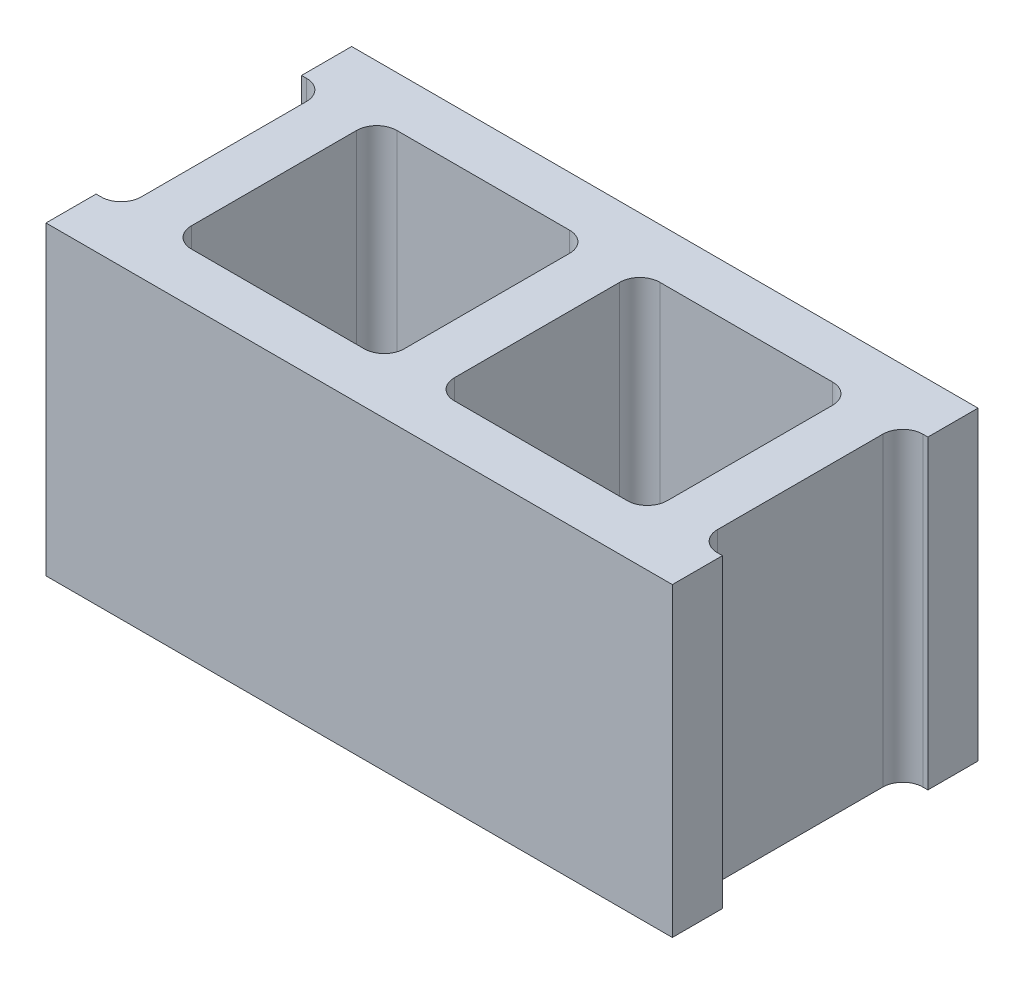
ISO-10303-21;
HEADER;
FILE_DESCRIPTION(('STEP AP214'),'2;1');
FILE_NAME('part.step','',(''),(''),'','','');
FILE_SCHEMA(('AUTOMOTIVE_DESIGN { 1 0 10303 214 1 1 1 1 }'));
ENDSEC;
DATA;
#1=APPLICATION_CONTEXT('core data for automotive mechanical design processes');
#2=APPLICATION_PROTOCOL_DEFINITION('international standard','automotive_design',2000,#1);
#3=PRODUCT_CONTEXT('',#1,'mechanical');
#4=PRODUCT('Part','Part','',(#3));
#5=PRODUCT_RELATED_PRODUCT_CATEGORY('part','',(#4));
#6=PRODUCT_DEFINITION_FORMATION('','',#4);
#7=PRODUCT_DEFINITION_CONTEXT('part definition',#1,'design');
#8=PRODUCT_DEFINITION('design','',#6,#7);
#9=PRODUCT_DEFINITION_SHAPE('','',#8);
#10=(LENGTH_UNIT() NAMED_UNIT(*) SI_UNIT(.MILLI.,.METRE.));
#11=(NAMED_UNIT(*) PLANE_ANGLE_UNIT() SI_UNIT($,.RADIAN.));
#12=(NAMED_UNIT(*) SI_UNIT($,.STERADIAN.) SOLID_ANGLE_UNIT());
#13=UNCERTAINTY_MEASURE_WITH_UNIT(LENGTH_MEASURE(1.E-05),#10,'distance_accuracy_value','');
#14=(GEOMETRIC_REPRESENTATION_CONTEXT(3) GLOBAL_UNCERTAINTY_ASSIGNED_CONTEXT((#13)) GLOBAL_UNIT_ASSIGNED_CONTEXT((#10,
#11,#12)) REPRESENTATION_CONTEXT('',''));
#15=CARTESIAN_POINT('',(0.,0.,0.));
#16=DIRECTION('',(0.,0.,1.));
#17=DIRECTION('',(1.,0.,0.));
#18=AXIS2_PLACEMENT_3D('',#15,#16,#17);
#19=CARTESIAN_POINT('',(195.262500000001,193.675,-52.3875));
#20=DIRECTION('',(0.,-1.,0.));
#21=DIRECTION('',(0.,0.,-1.));
#22=AXIS2_PLACEMENT_3D('',#19,#20,#21);
#23=PLANE('',#22);
#24=CARTESIAN_POINT('',(-138.1125,193.675,52.3874999999999));
#25=DIRECTION('',(0.,1.,0.));
#26=DIRECTION('',(0.,0.,-1.));
#27=AXIS2_PLACEMENT_3D('',#24,#25,#26);
#28=CIRCLE('',#27,12.7);
#29=CARTESIAN_POINT('',(-150.8125,193.675,52.3874999999998));
#30=VERTEX_POINT('',#29);
#31=CARTESIAN_POINT('',(-138.1125,193.675,65.0874999999998));
#32=VERTEX_POINT('',#31);
#33=EDGE_CURVE('E322',#30,#32,#28,.T.);
#34=ORIENTED_EDGE('',*,*,#33,.F.);
#35=DIRECTION('',(0.,0.,1.));
#36=VECTOR('',#35,1.);
#37=CARTESIAN_POINT('',(-150.8125,193.675,52.3874999999998));
#38=LINE('',#37,#36);
#39=CARTESIAN_POINT('',(-150.8125,193.675,-52.3875000000001));
#40=VERTEX_POINT('',#39);
#41=EDGE_CURVE('E338',#40,#30,#38,.T.);
#42=ORIENTED_EDGE('',*,*,#41,.F.);
#43=CARTESIAN_POINT('',(-138.1125,193.675,-52.3875000000001));
#44=DIRECTION('',(0.,1.,0.));
#45=DIRECTION('',(0.,0.,1.));
#46=AXIS2_PLACEMENT_3D('',#43,#44,#45);
#47=CIRCLE('',#46,12.7);
#48=CARTESIAN_POINT('',(-138.1125,193.675,-65.0875000000001));
#49=VERTEX_POINT('',#48);
#50=EDGE_CURVE('E335',#49,#40,#47,.T.);
#51=ORIENTED_EDGE('',*,*,#50,.F.);
#52=DIRECTION('',(-1.,0.,0.));
#53=VECTOR('',#52,1.);
#54=CARTESIAN_POINT('',(-28.575,193.675,-65.0875));
#55=LINE('',#54,#53);
#56=CARTESIAN_POINT('',(-28.575,193.675,-65.0875));
#57=VERTEX_POINT('',#56);
#58=EDGE_CURVE('E333',#57,#49,#55,.T.);
#59=ORIENTED_EDGE('',*,*,#58,.F.);
#60=CARTESIAN_POINT('',(-28.575,193.675,-52.3875));
#61=DIRECTION('',(0.,1.,0.));
#62=DIRECTION('',(0.,0.,1.));
#63=AXIS2_PLACEMENT_3D('',#60,#61,#62);
#64=CIRCLE('',#63,12.7);
#65=CARTESIAN_POINT('',(-15.875,193.675,-52.3875));
#66=VERTEX_POINT('',#65);
#67=EDGE_CURVE('E331',#66,#57,#64,.T.);
#68=ORIENTED_EDGE('',*,*,#67,.F.);
#69=DIRECTION('',(0.,0.,-1.));
#70=VECTOR('',#69,1.);
#71=CARTESIAN_POINT('',(-15.875,193.675,52.3875));
#72=LINE('',#71,#70);
#73=CARTESIAN_POINT('',(-15.875,193.675,52.3875));
#74=VERTEX_POINT('',#73);
#75=EDGE_CURVE('E329',#74,#66,#72,.T.);
#76=ORIENTED_EDGE('',*,*,#75,.F.);
#77=CARTESIAN_POINT('',(-28.575,193.675,52.3875));
#78=DIRECTION('',(0.,1.,0.));
#79=DIRECTION('',(0.,0.,1.));
#80=AXIS2_PLACEMENT_3D('',#77,#78,#79);
#81=CIRCLE('',#80,12.7);
#82=CARTESIAN_POINT('',(-28.575,193.675,65.0875));
#83=VERTEX_POINT('',#82);
#84=EDGE_CURVE('E327',#83,#74,#81,.T.);
#85=ORIENTED_EDGE('',*,*,#84,.F.);
#86=DIRECTION('',(1.,0.,0.));
#87=VECTOR('',#86,1.);
#88=CARTESIAN_POINT('',(-28.575,193.675,65.0875));
#89=LINE('',#88,#87);
#90=EDGE_CURVE('E324',#32,#83,#89,.T.);
#91=ORIENTED_EDGE('',*,*,#90,.F.);
#92=EDGE_LOOP('',(#34,#42,#51,#59,#68,#76,#85,#91));
#93=FACE_BOUND('',#92,.T.);
#94=DIRECTION('',(0.,0.,1.));
#95=VECTOR('',#94,1.);
#96=CARTESIAN_POINT('',(-198.4375,193.675,-65.0875));
#97=LINE('',#96,#95);
#98=CARTESIAN_POINT('',(-198.4375,193.675,-96.8375));
#99=VERTEX_POINT('',#98);
#100=CARTESIAN_POINT('',(-198.4375,193.675,-65.0875));
#101=VERTEX_POINT('',#100);
#102=EDGE_CURVE('E381',#99,#101,#97,.T.);
#103=ORIENTED_EDGE('',*,*,#102,.T.);
#104=DIRECTION('',(1.,0.,0.));
#105=VECTOR('',#104,1.);
#106=CARTESIAN_POINT('',(-198.4375,193.675,-65.0875));
#107=LINE('',#106,#105);
#108=CARTESIAN_POINT('',(-195.2625,193.675,-65.0875));
#109=VERTEX_POINT('',#108);
#110=EDGE_CURVE('E384',#101,#109,#107,.T.);
#111=ORIENTED_EDGE('',*,*,#110,.T.);
#112=CARTESIAN_POINT('',(-195.2625,193.675,-52.3875));
#113=DIRECTION('',(0.,-1.,0.));
#114=DIRECTION('',(0.,0.,1.));
#115=AXIS2_PLACEMENT_3D('',#112,#113,#114);
#116=CIRCLE('',#115,12.7);
#117=CARTESIAN_POINT('',(-182.5625,193.675,-52.3874999999999));
#118=VERTEX_POINT('',#117);
#119=EDGE_CURVE('E387',#109,#118,#116,.T.);
#120=ORIENTED_EDGE('',*,*,#119,.T.);
#121=DIRECTION('',(0.,0.,1.));
#122=VECTOR('',#121,1.);
#123=CARTESIAN_POINT('',(-182.5625,193.675,-52.3874999999999));
#124=LINE('',#123,#122);
#125=CARTESIAN_POINT('',(-182.5625,193.675,52.3874999999998));
#126=VERTEX_POINT('',#125);
#127=EDGE_CURVE('E389',#118,#126,#124,.T.);
#128=ORIENTED_EDGE('',*,*,#127,.T.);
#129=CARTESIAN_POINT('',(-195.2625,193.675,52.3874999999999));
#130=DIRECTION('',(0.,-1.,0.));
#131=DIRECTION('',(0.,0.,1.));
#132=AXIS2_PLACEMENT_3D('',#129,#130,#131);
#133=CIRCLE('',#132,12.7);
#134=CARTESIAN_POINT('',(-195.2625,193.675,65.0874999999999));
#135=VERTEX_POINT('',#134);
#136=EDGE_CURVE('E391',#126,#135,#133,.T.);
#137=ORIENTED_EDGE('',*,*,#136,.T.);
#138=DIRECTION('',(-1.,0.,0.));
#139=VECTOR('',#138,1.);
#140=CARTESIAN_POINT('',(-195.2625,193.675,65.0874999999999));
#141=LINE('',#140,#139);
#142=CARTESIAN_POINT('',(-198.4375,193.675,65.0874999999999));
#143=VERTEX_POINT('',#142);
#144=EDGE_CURVE('E393',#135,#143,#141,.T.);
#145=ORIENTED_EDGE('',*,*,#144,.T.);
#146=DIRECTION('',(0.,0.,1.));
#147=VECTOR('',#146,1.);
#148=CARTESIAN_POINT('',(-198.4375,193.675,96.8375));
#149=LINE('',#148,#147);
#150=CARTESIAN_POINT('',(-198.4375,193.675,96.8375));
#151=VERTEX_POINT('',#150);
#152=EDGE_CURVE('E395',#143,#151,#149,.T.);
#153=ORIENTED_EDGE('',*,*,#152,.T.);
#154=DIRECTION('',(1.,0.,0.));
#155=VECTOR('',#154,1.);
#156=CARTESIAN_POINT('',(198.4375,193.675,96.8374999999999));
#157=LINE('',#156,#155);
#158=CARTESIAN_POINT('',(198.4375,193.675,96.8374999999999));
#159=VERTEX_POINT('',#158);
#160=EDGE_CURVE('E397',#151,#159,#157,.T.);
#161=ORIENTED_EDGE('',*,*,#160,.T.);
#162=DIRECTION('',(0.,0.,-1.));
#163=VECTOR('',#162,1.);
#164=CARTESIAN_POINT('',(198.4375,193.675,96.8374999999999));
#165=LINE('',#164,#163);
#166=CARTESIAN_POINT('',(198.4375,193.675,65.0874999999999));
#167=VERTEX_POINT('',#166);
#168=EDGE_CURVE('E399',#159,#167,#165,.T.);
#169=ORIENTED_EDGE('',*,*,#168,.T.);
#170=DIRECTION('',(-1.,0.,0.));
#171=VECTOR('',#170,1.);
#172=CARTESIAN_POINT('',(195.262500000001,193.675,65.0874999999999));
#173=LINE('',#172,#171);
#174=CARTESIAN_POINT('',(195.262500000001,193.675,65.0874999999999));
#175=VERTEX_POINT('',#174);
#176=EDGE_CURVE('E401',#167,#175,#173,.T.);
#177=ORIENTED_EDGE('',*,*,#176,.T.);
#178=CARTESIAN_POINT('',(195.262500000001,193.675,52.3874999999999));
#179=DIRECTION('',(0.,-1.,0.));
#180=DIRECTION('',(0.,0.,-1.));
#181=AXIS2_PLACEMENT_3D('',#178,#179,#180);
#182=CIRCLE('',#181,12.7);
#183=CARTESIAN_POINT('',(182.562500000001,193.675,52.3874999999998));
#184=VERTEX_POINT('',#183);
#185=EDGE_CURVE('E403',#175,#184,#182,.T.);
#186=ORIENTED_EDGE('',*,*,#185,.T.);
#187=DIRECTION('',(0.,0.,-1.));
#188=VECTOR('',#187,1.);
#189=CARTESIAN_POINT('',(182.562500000001,193.675,-52.3874999999999));
#190=LINE('',#189,#188);
#191=CARTESIAN_POINT('',(182.562500000001,193.675,-52.3874999999999));
#192=VERTEX_POINT('',#191);
#193=EDGE_CURVE('E406',#184,#192,#190,.T.);
#194=ORIENTED_EDGE('',*,*,#193,.T.);
#195=CARTESIAN_POINT('',(195.262500000001,193.675,-52.3875));
#196=DIRECTION('',(0.,-1.,0.));
#197=DIRECTION('',(0.,0.,-1.));
#198=AXIS2_PLACEMENT_3D('',#195,#196,#197);
#199=CIRCLE('',#198,12.7);
#200=CARTESIAN_POINT('',(195.262500000001,193.675,-65.0875));
#201=VERTEX_POINT('',#200);
#202=EDGE_CURVE('E409',#192,#201,#199,.T.);
#203=ORIENTED_EDGE('',*,*,#202,.T.);
#204=DIRECTION('',(1.,0.,0.));
#205=VECTOR('',#204,1.);
#206=CARTESIAN_POINT('',(198.4375,193.675,-65.0875));
#207=LINE('',#206,#205);
#208=CARTESIAN_POINT('',(198.4375,193.675,-65.0875));
#209=VERTEX_POINT('',#208);
#210=EDGE_CURVE('E411',#201,#209,#207,.T.);
#211=ORIENTED_EDGE('',*,*,#210,.T.);
#212=DIRECTION('',(0.,0.,-1.));
#213=VECTOR('',#212,1.);
#214=CARTESIAN_POINT('',(198.4375,193.675,-65.0875));
#215=LINE('',#214,#213);
#216=CARTESIAN_POINT('',(198.4375,193.675,-96.8375));
#217=VERTEX_POINT('',#216);
#218=EDGE_CURVE('E413',#209,#217,#215,.T.);
#219=ORIENTED_EDGE('',*,*,#218,.T.);
#220=DIRECTION('',(-1.,0.,0.));
#221=VECTOR('',#220,1.);
#222=CARTESIAN_POINT('',(198.4375,193.675,-96.8375));
#223=LINE('',#222,#221);
#224=EDGE_CURVE('E415',#217,#99,#223,.T.);
#225=ORIENTED_EDGE('',*,*,#224,.T.);
#226=EDGE_LOOP('',(#103,#111,#120,#128,#137,#145,#153,#161,#169,#177,#186,#194,#203,#211,#219,#225));
#227=FACE_BOUND('',#226,.T.);
#228=CARTESIAN_POINT('',(28.575,193.675,-52.3875));
#229=DIRECTION('',(0.,1.,0.));
#230=DIRECTION('',(0.,0.,1.));
#231=AXIS2_PLACEMENT_3D('',#228,#229,#230);
#232=CIRCLE('',#231,12.7);
#233=CARTESIAN_POINT('',(28.575,193.675,-65.0875));
#234=VERTEX_POINT('',#233);
#235=CARTESIAN_POINT('',(15.875,193.675,-52.3875));
#236=VERTEX_POINT('',#235);
#237=EDGE_CURVE('E250',#234,#236,#232,.T.);
#238=ORIENTED_EDGE('',*,*,#237,.F.);
#239=DIRECTION('',(-1.,0.,0.));
#240=VECTOR('',#239,1.);
#241=CARTESIAN_POINT('',(138.1125,193.675,-65.0875));
#242=LINE('',#241,#240);
#243=CARTESIAN_POINT('',(138.1125,193.675,-65.0875));
#244=VERTEX_POINT('',#243);
#245=EDGE_CURVE('E287',#244,#234,#242,.T.);
#246=ORIENTED_EDGE('',*,*,#245,.F.);
#247=CARTESIAN_POINT('',(138.1125,193.675,-52.3875));
#248=DIRECTION('',(0.,1.,0.));
#249=DIRECTION('',(0.,0.,1.));
#250=AXIS2_PLACEMENT_3D('',#247,#248,#249);
#251=CIRCLE('',#250,12.7);
#252=CARTESIAN_POINT('',(150.8125,193.675,-52.3875));
#253=VERTEX_POINT('',#252);
#254=EDGE_CURVE('E285',#253,#244,#251,.T.);
#255=ORIENTED_EDGE('',*,*,#254,.F.);
#256=DIRECTION('',(0.,0.,-1.));
#257=VECTOR('',#256,1.);
#258=CARTESIAN_POINT('',(150.8125,193.675,52.3875));
#259=LINE('',#258,#257);
#260=CARTESIAN_POINT('',(150.8125,193.675,52.3875));
#261=VERTEX_POINT('',#260);
#262=EDGE_CURVE('E282',#261,#253,#259,.T.);
#263=ORIENTED_EDGE('',*,*,#262,.F.);
#264=CARTESIAN_POINT('',(138.1125,193.675,52.3875));
#265=DIRECTION('',(0.,1.,0.));
#266=DIRECTION('',(0.,0.,1.));
#267=AXIS2_PLACEMENT_3D('',#264,#265,#266);
#268=CIRCLE('',#267,12.7);
#269=CARTESIAN_POINT('',(138.1125,193.675,65.0875));
#270=VERTEX_POINT('',#269);
#271=EDGE_CURVE('E279',#270,#261,#268,.T.);
#272=ORIENTED_EDGE('',*,*,#271,.F.);
#273=DIRECTION('',(1.,0.,0.));
#274=VECTOR('',#273,1.);
#275=CARTESIAN_POINT('',(138.1125,193.675,65.0875));
#276=LINE('',#275,#274);
#277=CARTESIAN_POINT('',(28.575,193.675,65.0875));
#278=VERTEX_POINT('',#277);
#279=EDGE_CURVE('E274',#278,#270,#276,.T.);
#280=ORIENTED_EDGE('',*,*,#279,.F.);
#281=CARTESIAN_POINT('',(28.575,193.675,52.3875));
#282=DIRECTION('',(0.,1.,0.));
#283=DIRECTION('',(0.,0.,1.));
#284=AXIS2_PLACEMENT_3D('',#281,#282,#283);
#285=CIRCLE('',#284,12.7);
#286=CARTESIAN_POINT('',(15.875,193.675,52.3875));
#287=VERTEX_POINT('',#286);
#288=EDGE_CURVE('E272',#287,#278,#285,.T.);
#289=ORIENTED_EDGE('',*,*,#288,.F.);
#290=DIRECTION('',(0.,0.,1.));
#291=VECTOR('',#290,1.);
#292=CARTESIAN_POINT('',(15.875,193.675,52.3875));
#293=LINE('',#292,#291);
#294=EDGE_CURVE('E258',#236,#287,#293,.T.);
#295=ORIENTED_EDGE('',*,*,#294,.F.);
#296=EDGE_LOOP('',(#238,#246,#255,#263,#272,#280,#289,#295));
#297=FACE_BOUND('',#296,.T.);
#298=ADVANCED_FACE('F38',(#93,#227,#297),#23,.F.);
#299=CARTESIAN_POINT('',(195.262500000001,0.,-52.3875));
#300=DIRECTION('',(0.,-1.,0.));
#301=DIRECTION('',(0.,0.,-1.));
#302=AXIS2_PLACEMENT_3D('',#299,#300,#301);
#303=PLANE('',#302);
#304=DIRECTION('',(0.,0.,1.));
#305=VECTOR('',#304,1.);
#306=CARTESIAN_POINT('',(-150.8125,0.,52.3874999999998));
#307=LINE('',#306,#305);
#308=CARTESIAN_POINT('',(-150.8125,0.,-52.3875000000001));
#309=VERTEX_POINT('',#308);
#310=CARTESIAN_POINT('',(-150.8125,0.,52.3874999999998));
#311=VERTEX_POINT('',#310);
#312=EDGE_CURVE('E325',#309,#311,#307,.T.);
#313=ORIENTED_EDGE('',*,*,#312,.T.);
#314=CARTESIAN_POINT('',(-138.1125,0.,52.3874999999999));
#315=DIRECTION('',(0.,1.,0.));
#316=DIRECTION('',(0.,0.,-1.));
#317=AXIS2_PLACEMENT_3D('',#314,#315,#316);
#318=CIRCLE('',#317,12.7);
#319=CARTESIAN_POINT('',(-138.1125,0.,65.0874999999998));
#320=VERTEX_POINT('',#319);
#321=EDGE_CURVE('E267',#311,#320,#318,.T.);
#322=ORIENTED_EDGE('',*,*,#321,.T.);
#323=DIRECTION('',(1.,0.,0.));
#324=VECTOR('',#323,1.);
#325=CARTESIAN_POINT('',(-28.575,0.,65.0875));
#326=LINE('',#325,#324);
#327=CARTESIAN_POINT('',(-28.575,0.,65.0875));
#328=VERTEX_POINT('',#327);
#329=EDGE_CURVE('E343',#320,#328,#326,.T.);
#330=ORIENTED_EDGE('',*,*,#329,.T.);
#331=CARTESIAN_POINT('',(-28.575,0.,52.3875));
#332=DIRECTION('',(0.,1.,0.));
#333=DIRECTION('',(0.,0.,1.));
#334=AXIS2_PLACEMENT_3D('',#331,#332,#333);
#335=CIRCLE('',#334,12.7);
#336=CARTESIAN_POINT('',(-15.875,0.,52.3875));
#337=VERTEX_POINT('',#336);
#338=EDGE_CURVE('E346',#328,#337,#335,.T.);
#339=ORIENTED_EDGE('',*,*,#338,.T.);
#340=DIRECTION('',(0.,0.,-1.));
#341=VECTOR('',#340,1.);
#342=CARTESIAN_POINT('',(-15.875,0.,52.3875));
#343=LINE('',#342,#341);
#344=CARTESIAN_POINT('',(-15.875,0.,-52.3875));
#345=VERTEX_POINT('',#344);
#346=EDGE_CURVE('E349',#337,#345,#343,.T.);
#347=ORIENTED_EDGE('',*,*,#346,.T.);
#348=CARTESIAN_POINT('',(-28.575,0.,-52.3875));
#349=DIRECTION('',(0.,1.,0.));
#350=DIRECTION('',(0.,0.,1.));
#351=AXIS2_PLACEMENT_3D('',#348,#349,#350);
#352=CIRCLE('',#351,12.7);
#353=CARTESIAN_POINT('',(-28.575,0.,-65.0875));
#354=VERTEX_POINT('',#353);
#355=EDGE_CURVE('E352',#345,#354,#352,.T.);
#356=ORIENTED_EDGE('',*,*,#355,.T.);
#357=DIRECTION('',(-1.,0.,0.));
#358=VECTOR('',#357,1.);
#359=CARTESIAN_POINT('',(-28.575,0.,-65.0875));
#360=LINE('',#359,#358);
#361=CARTESIAN_POINT('',(-138.1125,0.,-65.0875000000001));
#362=VERTEX_POINT('',#361);
#363=EDGE_CURVE('E355',#354,#362,#360,.T.);
#364=ORIENTED_EDGE('',*,*,#363,.T.);
#365=CARTESIAN_POINT('',(-138.1125,0.,-52.3875000000001));
#366=DIRECTION('',(0.,1.,0.));
#367=DIRECTION('',(0.,0.,1.));
#368=AXIS2_PLACEMENT_3D('',#365,#366,#367);
#369=CIRCLE('',#368,12.7);
#370=EDGE_CURVE('E358',#362,#309,#369,.T.);
#371=ORIENTED_EDGE('',*,*,#370,.T.);
#372=EDGE_LOOP('',(#313,#322,#330,#339,#347,#356,#364,#371));
#373=FACE_BOUND('',#372,.T.);
#374=DIRECTION('',(0.,0.,1.));
#375=VECTOR('',#374,1.);
#376=CARTESIAN_POINT('',(-198.4375,0.,-65.0875));
#377=LINE('',#376,#375);
#378=CARTESIAN_POINT('',(-198.4375,0.,-96.8375));
#379=VERTEX_POINT('',#378);
#380=CARTESIAN_POINT('',(-198.4375,0.,-65.0875));
#381=VERTEX_POINT('',#380);
#382=EDGE_CURVE('E380',#379,#381,#377,.T.);
#383=ORIENTED_EDGE('',*,*,#382,.F.);
#384=DIRECTION('',(-1.,0.,0.));
#385=VECTOR('',#384,1.);
#386=CARTESIAN_POINT('',(198.4375,0.,-96.8375));
#387=LINE('',#386,#385);
#388=CARTESIAN_POINT('',(198.4375,0.,-96.8375));
#389=VERTEX_POINT('',#388);
#390=EDGE_CURVE('E385',#389,#379,#387,.T.);
#391=ORIENTED_EDGE('',*,*,#390,.F.);
#392=DIRECTION('',(0.,0.,-1.));
#393=VECTOR('',#392,1.);
#394=CARTESIAN_POINT('',(198.4375,0.,-65.0875));
#395=LINE('',#394,#393);
#396=CARTESIAN_POINT('',(198.4375,0.,-65.0875));
#397=VERTEX_POINT('',#396);
#398=EDGE_CURVE('E446',#397,#389,#395,.T.);
#399=ORIENTED_EDGE('',*,*,#398,.F.);
#400=DIRECTION('',(1.,0.,0.));
#401=VECTOR('',#400,1.);
#402=CARTESIAN_POINT('',(198.4375,0.,-65.0875));
#403=LINE('',#402,#401);
#404=CARTESIAN_POINT('',(195.262500000001,0.,-65.0875));
#405=VERTEX_POINT('',#404);
#406=EDGE_CURVE('E444',#405,#397,#403,.T.);
#407=ORIENTED_EDGE('',*,*,#406,.F.);
#408=CARTESIAN_POINT('',(195.262500000001,0.,-52.3875));
#409=DIRECTION('',(0.,-1.,0.));
#410=DIRECTION('',(0.,0.,-1.));
#411=AXIS2_PLACEMENT_3D('',#408,#409,#410);
#412=CIRCLE('',#411,12.7);
#413=CARTESIAN_POINT('',(182.562500000001,0.,-52.3874999999999));
#414=VERTEX_POINT('',#413);
#415=EDGE_CURVE('E442',#414,#405,#412,.T.);
#416=ORIENTED_EDGE('',*,*,#415,.F.);
#417=DIRECTION('',(0.,0.,-1.));
#418=VECTOR('',#417,1.);
#419=CARTESIAN_POINT('',(182.562500000001,0.,-52.3874999999999));
#420=LINE('',#419,#418);
#421=CARTESIAN_POINT('',(182.562500000001,0.,52.3874999999998));
#422=VERTEX_POINT('',#421);
#423=EDGE_CURVE('E440',#422,#414,#420,.T.);
#424=ORIENTED_EDGE('',*,*,#423,.F.);
#425=CARTESIAN_POINT('',(195.262500000001,0.,52.3874999999999));
#426=DIRECTION('',(0.,-1.,0.));
#427=DIRECTION('',(0.,0.,-1.));
#428=AXIS2_PLACEMENT_3D('',#425,#426,#427);
#429=CIRCLE('',#428,12.7);
#430=CARTESIAN_POINT('',(195.262500000001,0.,65.0874999999999));
#431=VERTEX_POINT('',#430);
#432=EDGE_CURVE('E438',#431,#422,#429,.T.);
#433=ORIENTED_EDGE('',*,*,#432,.F.);
#434=DIRECTION('',(-1.,0.,0.));
#435=VECTOR('',#434,1.);
#436=CARTESIAN_POINT('',(195.262500000001,0.,65.0874999999999));
#437=LINE('',#436,#435);
#438=CARTESIAN_POINT('',(198.4375,0.,65.0874999999999));
#439=VERTEX_POINT('',#438);
#440=EDGE_CURVE('E436',#439,#431,#437,.T.);
#441=ORIENTED_EDGE('',*,*,#440,.F.);
#442=DIRECTION('',(0.,0.,-1.));
#443=VECTOR('',#442,1.);
#444=CARTESIAN_POINT('',(198.4375,0.,96.8374999999999));
#445=LINE('',#444,#443);
#446=CARTESIAN_POINT('',(198.4375,0.,96.8374999999999));
#447=VERTEX_POINT('',#446);
#448=EDGE_CURVE('E434',#447,#439,#445,.T.);
#449=ORIENTED_EDGE('',*,*,#448,.F.);
#450=DIRECTION('',(1.,0.,0.));
#451=VECTOR('',#450,1.);
#452=CARTESIAN_POINT('',(198.4375,0.,96.8374999999999));
#453=LINE('',#452,#451);
#454=CARTESIAN_POINT('',(-198.4375,0.,96.8375));
#455=VERTEX_POINT('',#454);
#456=EDGE_CURVE('E432',#455,#447,#453,.T.);
#457=ORIENTED_EDGE('',*,*,#456,.F.);
#458=DIRECTION('',(0.,0.,1.));
#459=VECTOR('',#458,1.);
#460=CARTESIAN_POINT('',(-198.4375,0.,96.8375));
#461=LINE('',#460,#459);
#462=CARTESIAN_POINT('',(-198.4375,0.,65.0874999999999));
#463=VERTEX_POINT('',#462);
#464=EDGE_CURVE('E430',#463,#455,#461,.T.);
#465=ORIENTED_EDGE('',*,*,#464,.F.);
#466=DIRECTION('',(-1.,0.,0.));
#467=VECTOR('',#466,1.);
#468=CARTESIAN_POINT('',(-195.2625,0.,65.0874999999999));
#469=LINE('',#468,#467);
#470=CARTESIAN_POINT('',(-195.2625,0.,65.0874999999999));
#471=VERTEX_POINT('',#470);
#472=EDGE_CURVE('E428',#471,#463,#469,.T.);
#473=ORIENTED_EDGE('',*,*,#472,.F.);
#474=CARTESIAN_POINT('',(-195.2625,0.,52.3874999999999));
#475=DIRECTION('',(0.,-1.,0.));
#476=DIRECTION('',(0.,0.,1.));
#477=AXIS2_PLACEMENT_3D('',#474,#475,#476);
#478=CIRCLE('',#477,12.7);
#479=CARTESIAN_POINT('',(-182.5625,0.,52.3874999999998));
#480=VERTEX_POINT('',#479);
#481=EDGE_CURVE('E426',#480,#471,#478,.T.);
#482=ORIENTED_EDGE('',*,*,#481,.F.);
#483=DIRECTION('',(0.,0.,1.));
#484=VECTOR('',#483,1.);
#485=CARTESIAN_POINT('',(-182.5625,0.,-52.3874999999999));
#486=LINE('',#485,#484);
#487=CARTESIAN_POINT('',(-182.5625,0.,-52.3874999999999));
#488=VERTEX_POINT('',#487);
#489=EDGE_CURVE('E424',#488,#480,#486,.T.);
#490=ORIENTED_EDGE('',*,*,#489,.F.);
#491=CARTESIAN_POINT('',(-195.2625,0.,-52.3875));
#492=DIRECTION('',(0.,-1.,0.));
#493=DIRECTION('',(0.,0.,1.));
#494=AXIS2_PLACEMENT_3D('',#491,#492,#493);
#495=CIRCLE('',#494,12.7);
#496=CARTESIAN_POINT('',(-195.2625,0.,-65.0875));
#497=VERTEX_POINT('',#496);
#498=EDGE_CURVE('E422',#497,#488,#495,.T.);
#499=ORIENTED_EDGE('',*,*,#498,.F.);
#500=DIRECTION('',(1.,0.,0.));
#501=VECTOR('',#500,1.);
#502=CARTESIAN_POINT('',(-198.4375,0.,-65.0875));
#503=LINE('',#502,#501);
#504=EDGE_CURVE('E420',#381,#497,#503,.T.);
#505=ORIENTED_EDGE('',*,*,#504,.F.);
#506=EDGE_LOOP('',(#383,#391,#399,#407,#416,#424,#433,#441,#449,#457,#465,#473,#482,#490,#499,#505));
#507=FACE_BOUND('',#506,.T.);
#508=DIRECTION('',(-1.,0.,0.));
#509=VECTOR('',#508,1.);
#510=CARTESIAN_POINT('',(138.1125,0.,-65.0875));
#511=LINE('',#510,#509);
#512=CARTESIAN_POINT('',(138.1125,0.,-65.0875));
#513=VERTEX_POINT('',#512);
#514=CARTESIAN_POINT('',(28.575,0.,-65.0875));
#515=VERTEX_POINT('',#514);
#516=EDGE_CURVE('E259',#513,#515,#511,.T.);
#517=ORIENTED_EDGE('',*,*,#516,.T.);
#518=CARTESIAN_POINT('',(28.575,0.,-52.3875));
#519=DIRECTION('',(0.,1.,0.));
#520=DIRECTION('',(0.,0.,1.));
#521=AXIS2_PLACEMENT_3D('',#518,#519,#520);
#522=CIRCLE('',#521,12.7);
#523=CARTESIAN_POINT('',(15.875,0.,-52.3875));
#524=VERTEX_POINT('',#523);
#525=EDGE_CURVE('E61',#515,#524,#522,.T.);
#526=ORIENTED_EDGE('',*,*,#525,.T.);
#527=DIRECTION('',(0.,0.,1.));
#528=VECTOR('',#527,1.);
#529=CARTESIAN_POINT('',(15.875,0.,52.3875));
#530=LINE('',#529,#528);
#531=CARTESIAN_POINT('',(15.875,0.,52.3875));
#532=VERTEX_POINT('',#531);
#533=EDGE_CURVE('E265',#524,#532,#530,.T.);
#534=ORIENTED_EDGE('',*,*,#533,.T.);
#535=CARTESIAN_POINT('',(28.575,0.,52.3875));
#536=DIRECTION('',(0.,1.,0.));
#537=DIRECTION('',(0.,0.,1.));
#538=AXIS2_PLACEMENT_3D('',#535,#536,#537);
#539=CIRCLE('',#538,12.7);
#540=CARTESIAN_POINT('',(28.575,0.,65.0875));
#541=VERTEX_POINT('',#540);
#542=EDGE_CURVE('E291',#532,#541,#539,.T.);
#543=ORIENTED_EDGE('',*,*,#542,.T.);
#544=DIRECTION('',(1.,0.,0.));
#545=VECTOR('',#544,1.);
#546=CARTESIAN_POINT('',(138.1125,0.,65.0875));
#547=LINE('',#546,#545);
#548=CARTESIAN_POINT('',(138.1125,0.,65.0875));
#549=VERTEX_POINT('',#548);
#550=EDGE_CURVE('E294',#541,#549,#547,.T.);
#551=ORIENTED_EDGE('',*,*,#550,.T.);
#552=CARTESIAN_POINT('',(138.1125,0.,52.3875));
#553=DIRECTION('',(0.,1.,0.));
#554=DIRECTION('',(0.,0.,1.));
#555=AXIS2_PLACEMENT_3D('',#552,#553,#554);
#556=CIRCLE('',#555,12.7);
#557=CARTESIAN_POINT('',(150.8125,0.,52.3875));
#558=VERTEX_POINT('',#557);
#559=EDGE_CURVE('E297',#549,#558,#556,.T.);
#560=ORIENTED_EDGE('',*,*,#559,.T.);
#561=DIRECTION('',(0.,0.,-1.));
#562=VECTOR('',#561,1.);
#563=CARTESIAN_POINT('',(150.8125,0.,52.3875));
#564=LINE('',#563,#562);
#565=CARTESIAN_POINT('',(150.8125,0.,-52.3875));
#566=VERTEX_POINT('',#565);
#567=EDGE_CURVE('E300',#558,#566,#564,.T.);
#568=ORIENTED_EDGE('',*,*,#567,.T.);
#569=CARTESIAN_POINT('',(138.1125,0.,-52.3875));
#570=DIRECTION('',(0.,1.,0.));
#571=DIRECTION('',(0.,0.,1.));
#572=AXIS2_PLACEMENT_3D('',#569,#570,#571);
#573=CIRCLE('',#572,12.7);
#574=EDGE_CURVE('E303',#566,#513,#573,.T.);
#575=ORIENTED_EDGE('',*,*,#574,.T.);
#576=EDGE_LOOP('',(#517,#526,#534,#543,#551,#560,#568,#575));
#577=FACE_BOUND('',#576,.T.);
#578=ADVANCED_FACE('F501',(#373,#507,#577),#303,.T.);
#579=CARTESIAN_POINT('',(-198.4375,193.675,-65.0875));
#580=DIRECTION('',(1.,0.,0.));
#581=DIRECTION('',(0.,0.,-1.));
#582=AXIS2_PLACEMENT_3D('',#579,#580,#581);
#583=PLANE('',#582);
#584=ORIENTED_EDGE('',*,*,#382,.T.);
#585=DIRECTION('',(0.,-1.,0.));
#586=VECTOR('',#585,1.);
#587=CARTESIAN_POINT('',(-198.4375,193.675,-65.0875));
#588=LINE('',#587,#586);
#589=EDGE_CURVE('E11',#101,#381,#588,.T.);
#590=ORIENTED_EDGE('',*,*,#589,.F.);
#591=ORIENTED_EDGE('',*,*,#102,.F.);
#592=DIRECTION('',(0.,-1.,0.));
#593=VECTOR('',#592,1.);
#594=CARTESIAN_POINT('',(-198.4375,193.675,-96.8375));
#595=LINE('',#594,#593);
#596=EDGE_CURVE('E417',#99,#379,#595,.T.);
#597=ORIENTED_EDGE('',*,*,#596,.T.);
#598=EDGE_LOOP('',(#584,#590,#591,#597));
#599=FACE_BOUND('',#598,.T.);
#600=ADVANCED_FACE('F40',(#599),#583,.F.);
#601=CARTESIAN_POINT('',(-198.4375,193.675,-65.0875));
#602=DIRECTION('',(0.,0.,-1.));
#603=DIRECTION('',(-1.,0.,0.));
#604=AXIS2_PLACEMENT_3D('',#601,#602,#603);
#605=PLANE('',#604);
#606=ORIENTED_EDGE('',*,*,#504,.T.);
#607=DIRECTION('',(0.,-1.,0.));
#608=VECTOR('',#607,1.);
#609=CARTESIAN_POINT('',(-195.2625,193.675,-65.0875));
#610=LINE('',#609,#608);
#611=EDGE_CURVE('E46',#109,#497,#610,.T.);
#612=ORIENTED_EDGE('',*,*,#611,.F.);
#613=ORIENTED_EDGE('',*,*,#110,.F.);
#614=ORIENTED_EDGE('',*,*,#589,.T.);
#615=EDGE_LOOP('',(#606,#612,#613,#614));
#616=FACE_BOUND('',#615,.T.);
#617=ADVANCED_FACE('F518',(#616),#605,.F.);
#618=CARTESIAN_POINT('',(-195.2625,193.675,-52.3875));
#619=DIRECTION('',(0.,-1.,0.));
#620=DIRECTION('',(0.,0.,-1.));
#621=AXIS2_PLACEMENT_3D('',#618,#619,#620);
#622=CYLINDRICAL_SURFACE('',#621,12.7);
#623=ORIENTED_EDGE('',*,*,#498,.T.);
#624=DIRECTION('',(0.,-1.,0.));
#625=VECTOR('',#624,1.);
#626=CARTESIAN_POINT('',(-182.5625,193.675,-52.3874999999999));
#627=LINE('',#626,#625);
#628=EDGE_CURVE('E488',#118,#488,#627,.T.);
#629=ORIENTED_EDGE('',*,*,#628,.F.);
#630=ORIENTED_EDGE('',*,*,#119,.F.);
#631=ORIENTED_EDGE('',*,*,#611,.T.);
#632=EDGE_LOOP('',(#623,#629,#630,#631));
#633=FACE_BOUND('',#632,.T.);
#634=ADVANCED_FACE('F495',(#633),#622,.F.);
#635=CARTESIAN_POINT('',(-182.5625,193.675,-52.3874999999999));
#636=DIRECTION('',(1.,0.,0.));
#637=DIRECTION('',(0.,0.,-1.));
#638=AXIS2_PLACEMENT_3D('',#635,#636,#637);
#639=PLANE('',#638);
#640=ORIENTED_EDGE('',*,*,#489,.T.);
#641=DIRECTION('',(0.,-1.,0.));
#642=VECTOR('',#641,1.);
#643=CARTESIAN_POINT('',(-182.5625,193.675,52.3874999999998));
#644=LINE('',#643,#642);
#645=EDGE_CURVE('E485',#126,#480,#644,.T.);
#646=ORIENTED_EDGE('',*,*,#645,.F.);
#647=ORIENTED_EDGE('',*,*,#127,.F.);
#648=ORIENTED_EDGE('',*,*,#628,.T.);
#649=EDGE_LOOP('',(#640,#646,#647,#648));
#650=FACE_BOUND('',#649,.T.);
#651=ADVANCED_FACE('F507',(#650),#639,.F.);
#652=CARTESIAN_POINT('',(-195.2625,193.675,52.3874999999999));
#653=DIRECTION('',(0.,-1.,0.));
#654=DIRECTION('',(0.,0.,-1.));
#655=AXIS2_PLACEMENT_3D('',#652,#653,#654);
#656=CYLINDRICAL_SURFACE('',#655,12.7);
#657=ORIENTED_EDGE('',*,*,#481,.T.);
#658=DIRECTION('',(0.,-1.,0.));
#659=VECTOR('',#658,1.);
#660=CARTESIAN_POINT('',(-195.2625,193.675,65.0874999999999));
#661=LINE('',#660,#659);
#662=EDGE_CURVE('E482',#135,#471,#661,.T.);
#663=ORIENTED_EDGE('',*,*,#662,.F.);
#664=ORIENTED_EDGE('',*,*,#136,.F.);
#665=ORIENTED_EDGE('',*,*,#645,.T.);
#666=EDGE_LOOP('',(#657,#663,#664,#665));
#667=FACE_BOUND('',#666,.T.);
#668=ADVANCED_FACE('F511',(#667),#656,.F.);
#669=CARTESIAN_POINT('',(-195.2625,193.675,65.0874999999999));
#670=DIRECTION('',(0.,0.,1.));
#671=DIRECTION('',(1.,0.,0.));
#672=AXIS2_PLACEMENT_3D('',#669,#670,#671);
#673=PLANE('',#672);
#674=ORIENTED_EDGE('',*,*,#472,.T.);
#675=DIRECTION('',(0.,-1.,0.));
#676=VECTOR('',#675,1.);
#677=CARTESIAN_POINT('',(-198.4375,193.675,65.0874999999999));
#678=LINE('',#677,#676);
#679=EDGE_CURVE('E479',#143,#463,#678,.T.);
#680=ORIENTED_EDGE('',*,*,#679,.F.);
#681=ORIENTED_EDGE('',*,*,#144,.F.);
#682=ORIENTED_EDGE('',*,*,#662,.T.);
#683=EDGE_LOOP('',(#674,#680,#681,#682));
#684=FACE_BOUND('',#683,.T.);
#685=ADVANCED_FACE('F571',(#684),#673,.F.);
#686=CARTESIAN_POINT('',(-198.4375,193.675,96.8375));
#687=DIRECTION('',(1.,0.,0.));
#688=DIRECTION('',(0.,0.,-1.));
#689=AXIS2_PLACEMENT_3D('',#686,#687,#688);
#690=PLANE('',#689);
#691=ORIENTED_EDGE('',*,*,#464,.T.);
#692=DIRECTION('',(0.,-1.,0.));
#693=VECTOR('',#692,1.);
#694=CARTESIAN_POINT('',(-198.4375,193.675,96.8375));
#695=LINE('',#694,#693);
#696=EDGE_CURVE('E476',#151,#455,#695,.T.);
#697=ORIENTED_EDGE('',*,*,#696,.F.);
#698=ORIENTED_EDGE('',*,*,#152,.F.);
#699=ORIENTED_EDGE('',*,*,#679,.T.);
#700=EDGE_LOOP('',(#691,#697,#698,#699));
#701=FACE_BOUND('',#700,.T.);
#702=ADVANCED_FACE('F568',(#701),#690,.F.);
#703=CARTESIAN_POINT('',(198.4375,193.675,96.8374999999999));
#704=DIRECTION('',(0.,0.,-1.));
#705=DIRECTION('',(-1.,0.,0.));
#706=AXIS2_PLACEMENT_3D('',#703,#704,#705);
#707=PLANE('',#706);
#708=ORIENTED_EDGE('',*,*,#456,.T.);
#709=DIRECTION('',(0.,-1.,0.));
#710=VECTOR('',#709,1.);
#711=CARTESIAN_POINT('',(198.4375,193.675,96.8374999999999));
#712=LINE('',#711,#710);
#713=EDGE_CURVE('E473',#159,#447,#712,.T.);
#714=ORIENTED_EDGE('',*,*,#713,.F.);
#715=ORIENTED_EDGE('',*,*,#160,.F.);
#716=ORIENTED_EDGE('',*,*,#696,.T.);
#717=EDGE_LOOP('',(#708,#714,#715,#716));
#718=FACE_BOUND('',#717,.T.);
#719=ADVANCED_FACE('F564',(#718),#707,.F.);
#720=CARTESIAN_POINT('',(198.4375,193.675,96.8374999999999));
#721=DIRECTION('',(-1.,0.,0.));
#722=DIRECTION('',(0.,0.,1.));
#723=AXIS2_PLACEMENT_3D('',#720,#721,#722);
#724=PLANE('',#723);
#725=ORIENTED_EDGE('',*,*,#448,.T.);
#726=DIRECTION('',(0.,-1.,0.));
#727=VECTOR('',#726,1.);
#728=CARTESIAN_POINT('',(198.4375,193.675,65.0874999999999));
#729=LINE('',#728,#727);
#730=EDGE_CURVE('E470',#167,#439,#729,.T.);
#731=ORIENTED_EDGE('',*,*,#730,.F.);
#732=ORIENTED_EDGE('',*,*,#168,.F.);
#733=ORIENTED_EDGE('',*,*,#713,.T.);
#734=EDGE_LOOP('',(#725,#731,#732,#733));
#735=FACE_BOUND('',#734,.T.);
#736=ADVANCED_FACE('F560',(#735),#724,.F.);
#737=CARTESIAN_POINT('',(195.262500000001,193.675,65.0874999999999));
#738=DIRECTION('',(0.,0.,1.));
#739=DIRECTION('',(1.,0.,0.));
#740=AXIS2_PLACEMENT_3D('',#737,#738,#739);
#741=PLANE('',#740);
#742=ORIENTED_EDGE('',*,*,#440,.T.);
#743=DIRECTION('',(0.,-1.,0.));
#744=VECTOR('',#743,1.);
#745=CARTESIAN_POINT('',(195.262500000001,193.675,65.0874999999999));
#746=LINE('',#745,#744);
#747=EDGE_CURVE('E467',#175,#431,#746,.T.);
#748=ORIENTED_EDGE('',*,*,#747,.F.);
#749=ORIENTED_EDGE('',*,*,#176,.F.);
#750=ORIENTED_EDGE('',*,*,#730,.T.);
#751=EDGE_LOOP('',(#742,#748,#749,#750));
#752=FACE_BOUND('',#751,.T.);
#753=ADVANCED_FACE('F555',(#752),#741,.F.);
#754=CARTESIAN_POINT('',(195.262500000001,193.675,52.3874999999999));
#755=DIRECTION('',(0.,-1.,0.));
#756=DIRECTION('',(0.,0.,-1.));
#757=AXIS2_PLACEMENT_3D('',#754,#755,#756);
#758=CYLINDRICAL_SURFACE('',#757,12.7);
#759=ORIENTED_EDGE('',*,*,#432,.T.);
#760=DIRECTION('',(0.,-1.,0.));
#761=VECTOR('',#760,1.);
#762=CARTESIAN_POINT('',(182.562500000001,193.675,52.3874999999998));
#763=LINE('',#762,#761);
#764=EDGE_CURVE('E463',#184,#422,#763,.T.);
#765=ORIENTED_EDGE('',*,*,#764,.F.);
#766=ORIENTED_EDGE('',*,*,#185,.F.);
#767=ORIENTED_EDGE('',*,*,#747,.T.);
#768=EDGE_LOOP('',(#759,#765,#766,#767));
#769=FACE_BOUND('',#768,.T.);
#770=ADVANCED_FACE('F549',(#769),#758,.F.);
#771=CARTESIAN_POINT('',(182.562500000001,193.675,-52.3874999999999));
#772=DIRECTION('',(-1.,0.,0.));
#773=DIRECTION('',(0.,0.,1.));
#774=AXIS2_PLACEMENT_3D('',#771,#772,#773);
#775=PLANE('',#774);
#776=ORIENTED_EDGE('',*,*,#423,.T.);
#777=DIRECTION('',(0.,-1.,0.));
#778=VECTOR('',#777,1.);
#779=CARTESIAN_POINT('',(182.562500000001,193.675,-52.3874999999999));
#780=LINE('',#779,#778);
#781=EDGE_CURVE('E460',#192,#414,#780,.T.);
#782=ORIENTED_EDGE('',*,*,#781,.F.);
#783=ORIENTED_EDGE('',*,*,#193,.F.);
#784=ORIENTED_EDGE('',*,*,#764,.T.);
#785=EDGE_LOOP('',(#776,#782,#783,#784));
#786=FACE_BOUND('',#785,.T.);
#787=ADVANCED_FACE('F545',(#786),#775,.F.);
#788=CARTESIAN_POINT('',(195.262500000001,193.675,-52.3875));
#789=DIRECTION('',(0.,-1.,0.));
#790=DIRECTION('',(0.,0.,-1.));
#791=AXIS2_PLACEMENT_3D('',#788,#789,#790);
#792=CYLINDRICAL_SURFACE('',#791,12.7);
#793=ORIENTED_EDGE('',*,*,#415,.T.);
#794=DIRECTION('',(0.,-1.,0.));
#795=VECTOR('',#794,1.);
#796=CARTESIAN_POINT('',(195.262500000001,193.675,-65.0875));
#797=LINE('',#796,#795);
#798=EDGE_CURVE('E457',#201,#405,#797,.T.);
#799=ORIENTED_EDGE('',*,*,#798,.F.);
#800=ORIENTED_EDGE('',*,*,#202,.F.);
#801=ORIENTED_EDGE('',*,*,#781,.T.);
#802=EDGE_LOOP('',(#793,#799,#800,#801));
#803=FACE_BOUND('',#802,.T.);
#804=ADVANCED_FACE('F540',(#803),#792,.F.);
#805=CARTESIAN_POINT('',(198.4375,193.675,-65.0875));
#806=DIRECTION('',(0.,0.,-1.));
#807=DIRECTION('',(-1.,0.,0.));
#808=AXIS2_PLACEMENT_3D('',#805,#806,#807);
#809=PLANE('',#808);
#810=ORIENTED_EDGE('',*,*,#406,.T.);
#811=DIRECTION('',(0.,-1.,0.));
#812=VECTOR('',#811,1.);
#813=CARTESIAN_POINT('',(198.4375,193.675,-65.0875));
#814=LINE('',#813,#812);
#815=EDGE_CURVE('E454',#209,#397,#814,.T.);
#816=ORIENTED_EDGE('',*,*,#815,.F.);
#817=ORIENTED_EDGE('',*,*,#210,.F.);
#818=ORIENTED_EDGE('',*,*,#798,.T.);
#819=EDGE_LOOP('',(#810,#816,#817,#818));
#820=FACE_BOUND('',#819,.T.);
#821=ADVANCED_FACE('F534',(#820),#809,.F.);
#822=CARTESIAN_POINT('',(198.4375,193.675,-65.0875));
#823=DIRECTION('',(-1.,0.,0.));
#824=DIRECTION('',(0.,0.,1.));
#825=AXIS2_PLACEMENT_3D('',#822,#823,#824);
#826=PLANE('',#825);
#827=ORIENTED_EDGE('',*,*,#398,.T.);
#828=DIRECTION('',(0.,-1.,0.));
#829=VECTOR('',#828,1.);
#830=CARTESIAN_POINT('',(198.4375,193.675,-96.8375));
#831=LINE('',#830,#829);
#832=EDGE_CURVE('E451',#217,#389,#831,.T.);
#833=ORIENTED_EDGE('',*,*,#832,.F.);
#834=ORIENTED_EDGE('',*,*,#218,.F.);
#835=ORIENTED_EDGE('',*,*,#815,.T.);
#836=EDGE_LOOP('',(#827,#833,#834,#835));
#837=FACE_BOUND('',#836,.T.);
#838=ADVANCED_FACE('F530',(#837),#826,.F.);
#839=CARTESIAN_POINT('',(198.4375,193.675,-96.8375));
#840=DIRECTION('',(0.,0.,1.));
#841=DIRECTION('',(1.,0.,0.));
#842=AXIS2_PLACEMENT_3D('',#839,#840,#841);
#843=PLANE('',#842);
#844=ORIENTED_EDGE('',*,*,#390,.T.);
#845=ORIENTED_EDGE('',*,*,#596,.F.);
#846=ORIENTED_EDGE('',*,*,#224,.F.);
#847=ORIENTED_EDGE('',*,*,#832,.T.);
#848=EDGE_LOOP('',(#844,#845,#846,#847));
#849=FACE_BOUND('',#848,.T.);
#850=ADVANCED_FACE('F525',(#849),#843,.F.);
#851=CARTESIAN_POINT('',(-138.1125,193.675,52.3874999999999));
#852=DIRECTION('',(0.,-1.,0.));
#853=DIRECTION('',(0.,0.,-1.));
#854=AXIS2_PLACEMENT_3D('',#851,#852,#853);
#855=CYLINDRICAL_SURFACE('',#854,12.7);
#856=ORIENTED_EDGE('',*,*,#321,.F.);
#857=DIRECTION('',(0.,-1.,0.));
#858=VECTOR('',#857,1.);
#859=CARTESIAN_POINT('',(-150.8125,193.675,52.3874999999998));
#860=LINE('',#859,#858);
#861=EDGE_CURVE('E340',#30,#311,#860,.T.);
#862=ORIENTED_EDGE('',*,*,#861,.F.);
#863=ORIENTED_EDGE('',*,*,#33,.T.);
#864=DIRECTION('',(0.,-1.,0.));
#865=VECTOR('',#864,1.);
#866=CARTESIAN_POINT('',(-138.1125,193.675,65.0874999999998));
#867=LINE('',#866,#865);
#868=EDGE_CURVE('E377',#32,#320,#867,.T.);
#869=ORIENTED_EDGE('',*,*,#868,.T.);
#870=EDGE_LOOP('',(#856,#862,#863,#869));
#871=FACE_BOUND('',#870,.T.);
#872=ADVANCED_FACE('F590',(#871),#855,.F.);
#873=CARTESIAN_POINT('',(-28.575,193.675,65.0875));
#874=DIRECTION('',(0.,0.,-1.));
#875=DIRECTION('',(-1.,0.,0.));
#876=AXIS2_PLACEMENT_3D('',#873,#874,#875);
#877=PLANE('',#876);
#878=ORIENTED_EDGE('',*,*,#329,.F.);
#879=ORIENTED_EDGE('',*,*,#868,.F.);
#880=ORIENTED_EDGE('',*,*,#90,.T.);
#881=DIRECTION('',(0.,-1.,0.));
#882=VECTOR('',#881,1.);
#883=CARTESIAN_POINT('',(-28.575,193.675,65.0875));
#884=LINE('',#883,#882);
#885=EDGE_CURVE('E375',#83,#328,#884,.T.);
#886=ORIENTED_EDGE('',*,*,#885,.T.);
#887=EDGE_LOOP('',(#878,#879,#880,#886));
#888=FACE_BOUND('',#887,.T.);
#889=ADVANCED_FACE('F652',(#888),#877,.T.);
#890=CARTESIAN_POINT('',(-28.575,193.675,52.3875));
#891=DIRECTION('',(0.,-1.,0.));
#892=DIRECTION('',(0.,0.,-1.));
#893=AXIS2_PLACEMENT_3D('',#890,#891,#892);
#894=CYLINDRICAL_SURFACE('',#893,12.7);
#895=ORIENTED_EDGE('',*,*,#338,.F.);
#896=ORIENTED_EDGE('',*,*,#885,.F.);
#897=ORIENTED_EDGE('',*,*,#84,.T.);
#898=DIRECTION('',(0.,-1.,0.));
#899=VECTOR('',#898,1.);
#900=CARTESIAN_POINT('',(-15.875,193.675,52.3875));
#901=LINE('',#900,#899);
#902=EDGE_CURVE('E373',#74,#337,#901,.T.);
#903=ORIENTED_EDGE('',*,*,#902,.T.);
#904=EDGE_LOOP('',(#895,#896,#897,#903));
#905=FACE_BOUND('',#904,.T.);
#906=ADVANCED_FACE('F659',(#905),#894,.F.);
#907=CARTESIAN_POINT('',(-15.875,193.675,52.3875));
#908=DIRECTION('',(-1.,0.,0.));
#909=DIRECTION('',(0.,0.,1.));
#910=AXIS2_PLACEMENT_3D('',#907,#908,#909);
#911=PLANE('',#910);
#912=ORIENTED_EDGE('',*,*,#346,.F.);
#913=ORIENTED_EDGE('',*,*,#902,.F.);
#914=ORIENTED_EDGE('',*,*,#75,.T.);
#915=DIRECTION('',(0.,-1.,0.));
#916=VECTOR('',#915,1.);
#917=CARTESIAN_POINT('',(-15.875,193.675,-52.3875));
#918=LINE('',#917,#916);
#919=EDGE_CURVE('E371',#66,#345,#918,.T.);
#920=ORIENTED_EDGE('',*,*,#919,.T.);
#921=EDGE_LOOP('',(#912,#913,#914,#920));
#922=FACE_BOUND('',#921,.T.);
#923=ADVANCED_FACE('F666',(#922),#911,.T.);
#924=CARTESIAN_POINT('',(-28.575,193.675,-52.3875));
#925=DIRECTION('',(0.,-1.,0.));
#926=DIRECTION('',(0.,0.,-1.));
#927=AXIS2_PLACEMENT_3D('',#924,#925,#926);
#928=CYLINDRICAL_SURFACE('',#927,12.7);
#929=ORIENTED_EDGE('',*,*,#355,.F.);
#930=ORIENTED_EDGE('',*,*,#919,.F.);
#931=ORIENTED_EDGE('',*,*,#67,.T.);
#932=DIRECTION('',(0.,-1.,0.));
#933=VECTOR('',#932,1.);
#934=CARTESIAN_POINT('',(-28.575,193.675,-65.0875));
#935=LINE('',#934,#933);
#936=EDGE_CURVE('E369',#57,#354,#935,.T.);
#937=ORIENTED_EDGE('',*,*,#936,.T.);
#938=EDGE_LOOP('',(#929,#930,#931,#937));
#939=FACE_BOUND('',#938,.T.);
#940=ADVANCED_FACE('F674',(#939),#928,.F.);
#941=CARTESIAN_POINT('',(-28.575,193.675,-65.0875));
#942=DIRECTION('',(0.,0.,1.));
#943=DIRECTION('',(1.,0.,0.));
#944=AXIS2_PLACEMENT_3D('',#941,#942,#943);
#945=PLANE('',#944);
#946=ORIENTED_EDGE('',*,*,#363,.F.);
#947=ORIENTED_EDGE('',*,*,#936,.F.);
#948=ORIENTED_EDGE('',*,*,#58,.T.);
#949=DIRECTION('',(0.,-1.,0.));
#950=VECTOR('',#949,1.);
#951=CARTESIAN_POINT('',(-138.1125,193.675,-65.0875000000001));
#952=LINE('',#951,#950);
#953=EDGE_CURVE('E367',#49,#362,#952,.T.);
#954=ORIENTED_EDGE('',*,*,#953,.T.);
#955=EDGE_LOOP('',(#946,#947,#948,#954));
#956=FACE_BOUND('',#955,.T.);
#957=ADVANCED_FACE('F682',(#956),#945,.T.);
#958=CARTESIAN_POINT('',(-138.1125,193.675,-52.3875000000001));
#959=DIRECTION('',(0.,-1.,0.));
#960=DIRECTION('',(0.,0.,-1.));
#961=AXIS2_PLACEMENT_3D('',#958,#959,#960);
#962=CYLINDRICAL_SURFACE('',#961,12.7);
#963=ORIENTED_EDGE('',*,*,#370,.F.);
#964=ORIENTED_EDGE('',*,*,#953,.F.);
#965=ORIENTED_EDGE('',*,*,#50,.T.);
#966=DIRECTION('',(0.,-1.,0.));
#967=VECTOR('',#966,1.);
#968=CARTESIAN_POINT('',(-150.8125,193.675,-52.3875000000001));
#969=LINE('',#968,#967);
#970=EDGE_CURVE('E365',#40,#309,#969,.T.);
#971=ORIENTED_EDGE('',*,*,#970,.T.);
#972=EDGE_LOOP('',(#963,#964,#965,#971));
#973=FACE_BOUND('',#972,.T.);
#974=ADVANCED_FACE('F690',(#973),#962,.F.);
#975=CARTESIAN_POINT('',(-150.8125,193.675,52.3874999999998));
#976=DIRECTION('',(1.,0.,0.));
#977=DIRECTION('',(0.,0.,-1.));
#978=AXIS2_PLACEMENT_3D('',#975,#976,#977);
#979=PLANE('',#978);
#980=ORIENTED_EDGE('',*,*,#312,.F.);
#981=ORIENTED_EDGE('',*,*,#970,.F.);
#982=ORIENTED_EDGE('',*,*,#41,.T.);
#983=ORIENTED_EDGE('',*,*,#861,.T.);
#984=EDGE_LOOP('',(#980,#981,#982,#983));
#985=FACE_BOUND('',#984,.T.);
#986=ADVANCED_FACE('F698',(#985),#979,.T.);
#987=CARTESIAN_POINT('',(28.575,193.675,-52.3875));
#988=DIRECTION('',(0.,-1.,0.));
#989=DIRECTION('',(0.,0.,-1.));
#990=AXIS2_PLACEMENT_3D('',#987,#988,#989);
#991=CYLINDRICAL_SURFACE('',#990,12.7);
#992=ORIENTED_EDGE('',*,*,#525,.F.);
#993=DIRECTION('',(0.,-1.,0.));
#994=VECTOR('',#993,1.);
#995=CARTESIAN_POINT('',(28.575,193.675,-65.0875));
#996=LINE('',#995,#994);
#997=EDGE_CURVE('E254',#234,#515,#996,.T.);
#998=ORIENTED_EDGE('',*,*,#997,.F.);
#999=ORIENTED_EDGE('',*,*,#237,.T.);
#1000=DIRECTION('',(0.,-1.,0.));
#1001=VECTOR('',#1000,1.);
#1002=CARTESIAN_POINT('',(15.875,193.675,-52.3875));
#1003=LINE('',#1002,#1001);
#1004=EDGE_CURVE('E253',#236,#524,#1003,.T.);
#1005=ORIENTED_EDGE('',*,*,#1004,.T.);
#1006=EDGE_LOOP('',(#992,#998,#999,#1005));
#1007=FACE_BOUND('',#1006,.T.);
#1008=ADVANCED_FACE('F252',(#1007),#991,.F.);
#1009=CARTESIAN_POINT('',(15.875,193.675,52.3875));
#1010=DIRECTION('',(1.,0.,0.));
#1011=DIRECTION('',(0.,0.,-1.));
#1012=AXIS2_PLACEMENT_3D('',#1009,#1010,#1011);
#1013=PLANE('',#1012);
#1014=ORIENTED_EDGE('',*,*,#533,.F.);
#1015=ORIENTED_EDGE('',*,*,#1004,.F.);
#1016=ORIENTED_EDGE('',*,*,#294,.T.);
#1017=DIRECTION('',(0.,-1.,0.));
#1018=VECTOR('',#1017,1.);
#1019=CARTESIAN_POINT('',(15.875,193.675,52.3875));
#1020=LINE('',#1019,#1018);
#1021=EDGE_CURVE('E268',#287,#532,#1020,.T.);
#1022=ORIENTED_EDGE('',*,*,#1021,.T.);
#1023=EDGE_LOOP('',(#1014,#1015,#1016,#1022));
#1024=FACE_BOUND('',#1023,.T.);
#1025=ADVANCED_FACE('F262',(#1024),#1013,.T.);
#1026=CARTESIAN_POINT('',(28.575,193.675,52.3875));
#1027=DIRECTION('',(0.,-1.,0.));
#1028=DIRECTION('',(0.,0.,-1.));
#1029=AXIS2_PLACEMENT_3D('',#1026,#1027,#1028);
#1030=CYLINDRICAL_SURFACE('',#1029,12.7);
#1031=ORIENTED_EDGE('',*,*,#542,.F.);
#1032=ORIENTED_EDGE('',*,*,#1021,.F.);
#1033=ORIENTED_EDGE('',*,*,#288,.T.);
#1034=DIRECTION('',(0.,-1.,0.));
#1035=VECTOR('',#1034,1.);
#1036=CARTESIAN_POINT('',(28.575,193.675,65.0875));
#1037=LINE('',#1036,#1035);
#1038=EDGE_CURVE('E319',#278,#541,#1037,.T.);
#1039=ORIENTED_EDGE('',*,*,#1038,.T.);
#1040=EDGE_LOOP('',(#1031,#1032,#1033,#1039));
#1041=FACE_BOUND('',#1040,.T.);
#1042=ADVANCED_FACE('F717',(#1041),#1030,.F.);
#1043=CARTESIAN_POINT('',(138.1125,193.675,65.0875));
#1044=DIRECTION('',(0.,0.,-1.));
#1045=DIRECTION('',(-1.,0.,0.));
#1046=AXIS2_PLACEMENT_3D('',#1043,#1044,#1045);
#1047=PLANE('',#1046);
#1048=ORIENTED_EDGE('',*,*,#550,.F.);
#1049=ORIENTED_EDGE('',*,*,#1038,.F.);
#1050=ORIENTED_EDGE('',*,*,#279,.T.);
#1051=DIRECTION('',(0.,-1.,0.));
#1052=VECTOR('',#1051,1.);
#1053=CARTESIAN_POINT('',(138.1125,193.675,65.0875));
#1054=LINE('',#1053,#1052);
#1055=EDGE_CURVE('E316',#270,#549,#1054,.T.);
#1056=ORIENTED_EDGE('',*,*,#1055,.T.);
#1057=EDGE_LOOP('',(#1048,#1049,#1050,#1056));
#1058=FACE_BOUND('',#1057,.T.);
#1059=ADVANCED_FACE('F724',(#1058),#1047,.T.);
#1060=CARTESIAN_POINT('',(138.1125,193.675,52.3875));
#1061=DIRECTION('',(0.,-1.,0.));
#1062=DIRECTION('',(0.,0.,-1.));
#1063=AXIS2_PLACEMENT_3D('',#1060,#1061,#1062);
#1064=CYLINDRICAL_SURFACE('',#1063,12.7);
#1065=ORIENTED_EDGE('',*,*,#559,.F.);
#1066=ORIENTED_EDGE('',*,*,#1055,.F.);
#1067=ORIENTED_EDGE('',*,*,#271,.T.);
#1068=DIRECTION('',(0.,-1.,0.));
#1069=VECTOR('',#1068,1.);
#1070=CARTESIAN_POINT('',(150.8125,193.675,52.3875));
#1071=LINE('',#1070,#1069);
#1072=EDGE_CURVE('E313',#261,#558,#1071,.T.);
#1073=ORIENTED_EDGE('',*,*,#1072,.T.);
#1074=EDGE_LOOP('',(#1065,#1066,#1067,#1073));
#1075=FACE_BOUND('',#1074,.T.);
#1076=ADVANCED_FACE('F732',(#1075),#1064,.F.);
#1077=CARTESIAN_POINT('',(150.8125,193.675,52.3875));
#1078=DIRECTION('',(-1.,0.,0.));
#1079=DIRECTION('',(0.,0.,1.));
#1080=AXIS2_PLACEMENT_3D('',#1077,#1078,#1079);
#1081=PLANE('',#1080);
#1082=ORIENTED_EDGE('',*,*,#567,.F.);
#1083=ORIENTED_EDGE('',*,*,#1072,.F.);
#1084=ORIENTED_EDGE('',*,*,#262,.T.);
#1085=DIRECTION('',(0.,-1.,0.));
#1086=VECTOR('',#1085,1.);
#1087=CARTESIAN_POINT('',(150.8125,193.675,-52.3875));
#1088=LINE('',#1087,#1086);
#1089=EDGE_CURVE('E311',#253,#566,#1088,.T.);
#1090=ORIENTED_EDGE('',*,*,#1089,.T.);
#1091=EDGE_LOOP('',(#1082,#1083,#1084,#1090));
#1092=FACE_BOUND('',#1091,.T.);
#1093=ADVANCED_FACE('F740',(#1092),#1081,.T.);
#1094=CARTESIAN_POINT('',(138.1125,193.675,-52.3875));
#1095=DIRECTION('',(0.,-1.,0.));
#1096=DIRECTION('',(0.,0.,-1.));
#1097=AXIS2_PLACEMENT_3D('',#1094,#1095,#1096);
#1098=CYLINDRICAL_SURFACE('',#1097,12.7);
#1099=ORIENTED_EDGE('',*,*,#574,.F.);
#1100=ORIENTED_EDGE('',*,*,#1089,.F.);
#1101=ORIENTED_EDGE('',*,*,#254,.T.);
#1102=DIRECTION('',(0.,-1.,0.));
#1103=VECTOR('',#1102,1.);
#1104=CARTESIAN_POINT('',(138.1125,193.675,-65.0875));
#1105=LINE('',#1104,#1103);
#1106=EDGE_CURVE('E53',#244,#513,#1105,.T.);
#1107=ORIENTED_EDGE('',*,*,#1106,.T.);
#1108=EDGE_LOOP('',(#1099,#1100,#1101,#1107));
#1109=FACE_BOUND('',#1108,.T.);
#1110=ADVANCED_FACE('F749',(#1109),#1098,.F.);
#1111=CARTESIAN_POINT('',(138.1125,193.675,-65.0875));
#1112=DIRECTION('',(0.,0.,1.));
#1113=DIRECTION('',(1.,0.,0.));
#1114=AXIS2_PLACEMENT_3D('',#1111,#1112,#1113);
#1115=PLANE('',#1114);
#1116=ORIENTED_EDGE('',*,*,#516,.F.);
#1117=ORIENTED_EDGE('',*,*,#1106,.F.);
#1118=ORIENTED_EDGE('',*,*,#245,.T.);
#1119=ORIENTED_EDGE('',*,*,#997,.T.);
#1120=EDGE_LOOP('',(#1116,#1117,#1118,#1119));
#1121=FACE_BOUND('',#1120,.T.);
#1122=ADVANCED_FACE('F756',(#1121),#1115,.T.);
#1123=CLOSED_SHELL('',(#298,#578,#600,#617,#634,#651,#668,#685,#702,#719,#736,#753,#770,#787,
#804,#821,#838,#850,#872,#889,#906,#923,#940,#957,#974,#986,#1008,#1025,#1042,#1059,#1076,#1093,
#1110,#1122));
#1124=MANIFOLD_SOLID_BREP('B2',#1123);
#1125=ADVANCED_BREP_SHAPE_REPRESENTATION('',(#18,#1124),#14);
#1126=SHAPE_DEFINITION_REPRESENTATION(#9,#1125);
ENDSEC;
END-ISO-10303-21;
